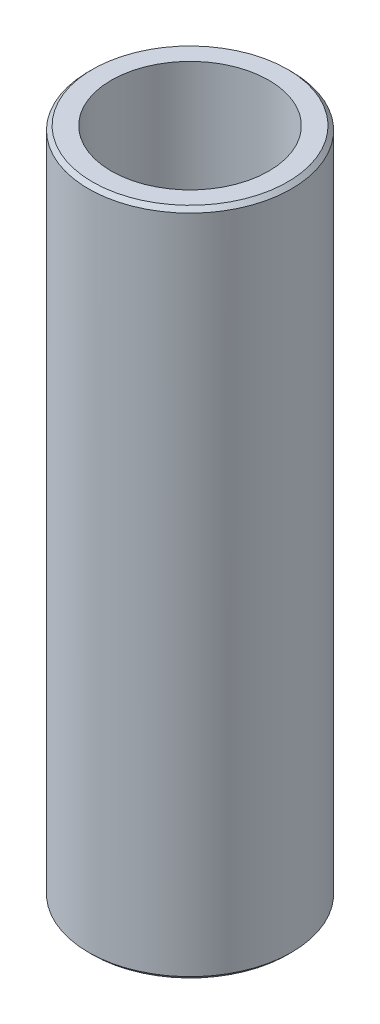
ISO-10303-21;
HEADER;
FILE_DESCRIPTION(('STEP AP214'),'2;1');
FILE_NAME('part.step','',(''),(''),'','','');
FILE_SCHEMA(('AUTOMOTIVE_DESIGN { 1 0 10303 214 1 1 1 1 }'));
ENDSEC;
DATA;
#1=APPLICATION_CONTEXT('core data for automotive mechanical design processes');
#2=APPLICATION_PROTOCOL_DEFINITION('international standard','automotive_design',2000,#1);
#3=PRODUCT_CONTEXT('',#1,'mechanical');
#4=PRODUCT('Part','Part','',(#3));
#5=PRODUCT_RELATED_PRODUCT_CATEGORY('part','',(#4));
#6=PRODUCT_DEFINITION_FORMATION('','',#4);
#7=PRODUCT_DEFINITION_CONTEXT('part definition',#1,'design');
#8=PRODUCT_DEFINITION('design','',#6,#7);
#9=PRODUCT_DEFINITION_SHAPE('','',#8);
#10=(LENGTH_UNIT() NAMED_UNIT(*) SI_UNIT(.MILLI.,.METRE.));
#11=(NAMED_UNIT(*) PLANE_ANGLE_UNIT() SI_UNIT($,.RADIAN.));
#12=(NAMED_UNIT(*) SI_UNIT($,.STERADIAN.) SOLID_ANGLE_UNIT());
#13=UNCERTAINTY_MEASURE_WITH_UNIT(LENGTH_MEASURE(1.E-05),#10,'distance_accuracy_value','');
#14=(GEOMETRIC_REPRESENTATION_CONTEXT(3) GLOBAL_UNCERTAINTY_ASSIGNED_CONTEXT((#13)) GLOBAL_UNIT_ASSIGNED_CONTEXT((#10,
#11,#12)) REPRESENTATION_CONTEXT('',''));
#15=CARTESIAN_POINT('',(0.,0.,0.));
#16=DIRECTION('',(0.,0.,1.));
#17=DIRECTION('',(1.,0.,0.));
#18=AXIS2_PLACEMENT_3D('',#15,#16,#17);
#19=CARTESIAN_POINT('',(0.,378.887556557986,0.));
#20=DIRECTION('',(0.,-1.,0.));
#21=DIRECTION('',(0.,0.,-1.));
#22=AXIS2_PLACEMENT_3D('',#19,#20,#21);
#23=CYLINDRICAL_SURFACE('',#22,57.5);
#24=CARTESIAN_POINT('',(0.,376.635877450938,0.));
#25=DIRECTION('',(0.,1.,0.));
#26=DIRECTION('',(0.,0.,1.));
#27=AXIS2_PLACEMENT_3D('',#24,#25,#26);
#28=CIRCLE('',#27,57.5);
#29=CARTESIAN_POINT('',(0.,376.635877450938,-57.5));
#30=VERTEX_POINT('',#29);
#31=EDGE_CURVE('E50',#30,#30,#28,.F.);
#32=CARTESIAN_POINT('',(0.,2.25167910704882,0.));
#33=DIRECTION('',(0.,1.,0.));
#34=DIRECTION('',(0.,0.,1.));
#35=AXIS2_PLACEMENT_3D('',#32,#33,#34);
#36=CIRCLE('',#35,57.5);
#37=CARTESIAN_POINT('',(0.,2.25167910704882,-57.5));
#38=VERTEX_POINT('',#37);
#39=EDGE_CURVE('E51',#38,#38,#36,.T.);
#40=CARTESIAN_POINT('',(0.,376.635877450938,-57.5));
#41=CARTESIAN_POINT('',(0.,372.736042051522,-57.5));
#42=CARTESIAN_POINT('',(0.,368.836206652107,-57.5));
#43=CARTESIAN_POINT('',(0.,361.036535853276,-57.5));
#44=CARTESIAN_POINT('',(0.,357.13670045386,-57.5));
#45=CARTESIAN_POINT('',(0.,349.337029655029,-57.5));
#46=CARTESIAN_POINT('',(0.,345.437194255614,-57.5));
#47=CARTESIAN_POINT('',(0.,337.637523456783,-57.5));
#48=CARTESIAN_POINT('',(0.,333.737688057367,-57.5));
#49=CARTESIAN_POINT('',(0.,325.938017258536,-57.5));
#50=CARTESIAN_POINT('',(0.,322.038181859121,-57.5));
#51=CARTESIAN_POINT('',(0.,314.23851106029,-57.5));
#52=CARTESIAN_POINT('',(0.,310.338675660874,-57.5));
#53=CARTESIAN_POINT('',(0.,302.539004862043,-57.5));
#54=CARTESIAN_POINT('',(0.,298.639169462628,-57.5));
#55=CARTESIAN_POINT('',(0.,290.839498663797,-57.5));
#56=CARTESIAN_POINT('',(0.,286.939663264381,-57.5));
#57=CARTESIAN_POINT('',(0.,279.13999246555,-57.5));
#58=CARTESIAN_POINT('',(0.,275.240157066135,-57.5));
#59=CARTESIAN_POINT('',(0.,267.440486267304,-57.5));
#60=CARTESIAN_POINT('',(0.,263.540650867888,-57.5));
#61=CARTESIAN_POINT('',(0.,255.740980069057,-57.5));
#62=CARTESIAN_POINT('',(0.,251.841144669642,-57.5));
#63=CARTESIAN_POINT('',(0.,244.041473870811,-57.5));
#64=CARTESIAN_POINT('',(0.,240.141638471395,-57.5));
#65=CARTESIAN_POINT('',(0.,232.341967672564,-57.5));
#66=CARTESIAN_POINT('',(0.,228.442132273149,-57.5));
#67=CARTESIAN_POINT('',(0.,220.642461474317,-57.5));
#68=CARTESIAN_POINT('',(0.,216.742626074902,-57.5));
#69=CARTESIAN_POINT('',(0.,208.942955276071,-57.5));
#70=CARTESIAN_POINT('',(0.,205.043119876655,-57.5));
#71=CARTESIAN_POINT('',(0.,197.243449077824,-57.5));
#72=CARTESIAN_POINT('',(0.,193.343613678409,-57.5));
#73=CARTESIAN_POINT('',(0.,185.543942879578,-57.5));
#74=CARTESIAN_POINT('',(0.,181.644107480162,-57.5));
#75=CARTESIAN_POINT('',(0.,173.844436681331,-57.5));
#76=CARTESIAN_POINT('',(0.,169.944601281916,-57.5));
#77=CARTESIAN_POINT('',(0.,162.144930483085,-57.5));
#78=CARTESIAN_POINT('',(0.,158.245095083669,-57.5));
#79=CARTESIAN_POINT('',(0.,150.445424284838,-57.5));
#80=CARTESIAN_POINT('',(0.,146.545588885423,-57.5));
#81=CARTESIAN_POINT('',(0.,138.745918086592,-57.5));
#82=CARTESIAN_POINT('',(0.,134.846082687176,-57.5));
#83=CARTESIAN_POINT('',(0.,127.046411888345,-57.5));
#84=CARTESIAN_POINT('',(0.,123.14657648893,-57.5));
#85=CARTESIAN_POINT('',(0.,115.346905690099,-57.5));
#86=CARTESIAN_POINT('',(0.,111.447070290683,-57.5));
#87=CARTESIAN_POINT('',(0.,103.647399491852,-57.5));
#88=CARTESIAN_POINT('',(0.,99.7475640924366,-57.5));
#89=CARTESIAN_POINT('',(0.,91.9478932936056,-57.5));
#90=CARTESIAN_POINT('',(0.,88.0480578941901,-57.5));
#91=CARTESIAN_POINT('',(0.,80.2483870953591,-57.5));
#92=CARTESIAN_POINT('',(0.,76.3485516959436,-57.5));
#93=CARTESIAN_POINT('',(0.,68.5488808971125,-57.5));
#94=CARTESIAN_POINT('',(0.,64.649045497697,-57.5));
#95=CARTESIAN_POINT('',(0.,56.849374698866,-57.5));
#96=CARTESIAN_POINT('',(0.,52.9495392994505,-57.5));
#97=CARTESIAN_POINT('',(0.,45.1498685006194,-57.5));
#98=CARTESIAN_POINT('',(0.,41.2500331012039,-57.5));
#99=CARTESIAN_POINT('',(0.,33.4503623023729,-57.5));
#100=CARTESIAN_POINT('',(0.,29.5505269029573,-57.5));
#101=CARTESIAN_POINT('',(0.,21.7508561041263,-57.5));
#102=CARTESIAN_POINT('',(0.,17.8510207047109,-57.5));
#103=CARTESIAN_POINT('',(0.,10.0513499058799,-57.5));
#104=CARTESIAN_POINT('',(0.,6.15151450646434,-57.5));
#105=CARTESIAN_POINT('',(0.,2.25167910704882,-57.5));
#106=B_SPLINE_CURVE_WITH_KNOTS('',3,(#40,#41,#42,#43,#44,#45,#46,#47,#48,#49,#50,#51,#52,#53,
#54,#55,#56,#57,#58,#59,#60,#61,#62,#63,#64,#65,#66,#67,#68,#69,#70,#71,#72,#73,#74,#75,#76,#77,
#78,#79,#80,#81,#82,#83,#84,#85,#86,#87,#88,#89,#90,#91,#92,#93,#94,#95,#96,#97,#98,#99,#100,
#101,#102,#103,#104,#105),.UNSPECIFIED.,.F.,.F.,(4,2,2,2,2,2,2,2,2,2,2,2,2,2,2,2,2,2,2,2,2,2,2,
2,2,2,2,2,2,2,2,2,4),(0.,11.6995061982466,23.3990123964931,35.0985185947396,46.7980247929862,
58.4975309912327,70.1970371894792,81.8965433877258,93.5960495859723,105.295555784219,
116.995061982465,128.694568180712,140.394074378958,152.093580577205,163.793086775452,
175.492592973698,187.192099171945,198.891605370191,210.591111568438,222.290617766684,
233.990123964931,245.689630163177,257.389136361424,269.08864255967,280.788148757917,
292.487654956163,304.18716115441,315.886667352657,327.586173550903,339.28567974915,
350.985185947396,362.684692145643,374.384198343889),.UNSPECIFIED.);
#107=EDGE_CURVE('BSEAM39',#30,#38,#106,.T.);
#108=ORIENTED_EDGE('',*,*,#31,.T.);
#109=ORIENTED_EDGE('',*,*,#39,.T.);
#110=ORIENTED_EDGE('',*,*,#107,.T.);
#111=ORIENTED_EDGE('',*,*,#107,.F.);
#112=EDGE_LOOP('',(#108,#110,#109,#111));
#113=FACE_BOUND('',#112,.T.);
#114=ADVANCED_FACE('F39',(#113),#23,.T.);
#115=CARTESIAN_POINT('',(0.,378.887556557986,0.));
#116=DIRECTION('',(0.,1.,0.));
#117=DIRECTION('',(0.,0.,1.));
#118=AXIS2_PLACEMENT_3D('',#115,#116,#117);
#119=PLANE('',#118);
#120=CARTESIAN_POINT('',(0.,378.887556557986,0.));
#121=DIRECTION('',(0.,1.,0.));
#122=DIRECTION('',(0.,0.,1.));
#123=AXIS2_PLACEMENT_3D('',#120,#121,#122);
#124=CIRCLE('',#123,55.2483208929515);
#125=CARTESIAN_POINT('',(0.,378.887556557986,55.2483208929515));
#126=VERTEX_POINT('',#125);
#127=EDGE_CURVE('E54',#126,#126,#124,.T.);
#128=ORIENTED_EDGE('',*,*,#127,.T.);
#129=EDGE_LOOP('',(#128));
#130=FACE_BOUND('',#129,.T.);
#131=CARTESIAN_POINT('',(0.,378.887556557986,0.));
#132=DIRECTION('',(0.,1.,0.));
#133=DIRECTION('',(0.,0.,1.));
#134=AXIS2_PLACEMENT_3D('',#131,#132,#133);
#135=CIRCLE('',#134,44.6006034622384);
#136=CARTESIAN_POINT('',(0.,378.887556557986,-44.6006034622384));
#137=VERTEX_POINT('',#136);
#138=EDGE_CURVE('E58',#137,#137,#135,.T.);
#139=ORIENTED_EDGE('',*,*,#138,.F.);
#140=EDGE_LOOP('',(#139));
#141=FACE_BOUND('',#140,.T.);
#142=ADVANCED_FACE('F69',(#130,#141),#119,.T.);
#143=CARTESIAN_POINT('',(0.,0.,0.));
#144=DIRECTION('',(0.,1.,0.));
#145=DIRECTION('',(0.,0.,1.));
#146=AXIS2_PLACEMENT_3D('',#143,#144,#145);
#147=PLANE('',#146);
#148=CARTESIAN_POINT('',(0.,0.,0.));
#149=DIRECTION('',(0.,1.,0.));
#150=DIRECTION('',(0.,0.,1.));
#151=AXIS2_PLACEMENT_3D('',#148,#149,#150);
#152=CIRCLE('',#151,55.2483208929512);
#153=CARTESIAN_POINT('',(0.,0.,55.2483208929512));
#154=VERTEX_POINT('',#153);
#155=EDGE_CURVE('E10',#154,#154,#152,.F.);
#156=ORIENTED_EDGE('',*,*,#155,.T.);
#157=EDGE_LOOP('',(#156));
#158=FACE_BOUND('',#157,.T.);
#159=CARTESIAN_POINT('',(0.,0.,0.));
#160=DIRECTION('',(0.,1.,0.));
#161=DIRECTION('',(0.,0.,1.));
#162=AXIS2_PLACEMENT_3D('',#159,#160,#161);
#163=CIRCLE('',#162,44.6006034622384);
#164=CARTESIAN_POINT('',(0.,0.,-44.6006034622384));
#165=VERTEX_POINT('',#164);
#166=EDGE_CURVE('E63',#165,#165,#163,.T.);
#167=ORIENTED_EDGE('',*,*,#166,.T.);
#168=EDGE_LOOP('',(#167));
#169=FACE_BOUND('',#168,.T.);
#170=ADVANCED_FACE('F75',(#158,#169),#147,.F.);
#171=CARTESIAN_POINT('',(0.,378.887556557986,0.));
#172=DIRECTION('',(0.,-1.,0.));
#173=DIRECTION('',(0.,0.,-1.));
#174=AXIS2_PLACEMENT_3D('',#171,#172,#173);
#175=CYLINDRICAL_SURFACE('',#174,44.6006034622384);
#176=CARTESIAN_POINT('',(0.,378.887556557986,-44.6006034622384));
#177=CARTESIAN_POINT('',(0.,374.940811177174,-44.6006034622384));
#178=CARTESIAN_POINT('',(0.,370.994065796362,-44.6006034622384));
#179=CARTESIAN_POINT('',(0.,363.100575034737,-44.6006034622384));
#180=CARTESIAN_POINT('',(0.,359.153829653925,-44.6006034622384));
#181=CARTESIAN_POINT('',(0.,351.2603388923,-44.6006034622384));
#182=CARTESIAN_POINT('',(0.,347.313593511488,-44.6006034622384));
#183=CARTESIAN_POINT('',(0.,339.420102749863,-44.6006034622384));
#184=CARTESIAN_POINT('',(0.,335.473357369051,-44.6006034622384));
#185=CARTESIAN_POINT('',(0.,327.579866607426,-44.6006034622384));
#186=CARTESIAN_POINT('',(0.,323.633121226613,-44.6006034622384));
#187=CARTESIAN_POINT('',(0.,315.739630464989,-44.6006034622384));
#188=CARTESIAN_POINT('',(0.,311.792885084176,-44.6006034622384));
#189=CARTESIAN_POINT('',(0.,303.899394322552,-44.6006034622384));
#190=CARTESIAN_POINT('',(0.,299.952648941739,-44.6006034622384));
#191=CARTESIAN_POINT('',(0.,292.059158180115,-44.6006034622384));
#192=CARTESIAN_POINT('',(0.,288.112412799302,-44.6006034622384));
#193=CARTESIAN_POINT('',(0.,280.218922037677,-44.6006034622384));
#194=CARTESIAN_POINT('',(0.,276.272176656865,-44.6006034622384));
#195=CARTESIAN_POINT('',(0.,268.37868589524,-44.6006034622384));
#196=CARTESIAN_POINT('',(0.,264.431940514428,-44.6006034622384));
#197=CARTESIAN_POINT('',(0.,256.538449752803,-44.6006034622384));
#198=CARTESIAN_POINT('',(0.,252.591704371991,-44.6006034622384));
#199=CARTESIAN_POINT('',(0.,244.698213610366,-44.6006034622384));
#200=CARTESIAN_POINT('',(0.,240.751468229554,-44.6006034622384));
#201=CARTESIAN_POINT('',(0.,232.857977467929,-44.6006034622384));
#202=CARTESIAN_POINT('',(0.,228.911232087117,-44.6006034622384));
#203=CARTESIAN_POINT('',(0.,221.017741325492,-44.6006034622384));
#204=CARTESIAN_POINT('',(0.,217.07099594468,-44.6006034622384));
#205=CARTESIAN_POINT('',(0.,209.177505183055,-44.6006034622384));
#206=CARTESIAN_POINT('',(0.,205.230759802243,-44.6006034622384));
#207=CARTESIAN_POINT('',(0.,197.337269040618,-44.6006034622384));
#208=CARTESIAN_POINT('',(0.,193.390523659806,-44.6006034622384));
#209=CARTESIAN_POINT('',(0.,185.497032898181,-44.6006034622384));
#210=CARTESIAN_POINT('',(0.,181.550287517369,-44.6006034622384));
#211=CARTESIAN_POINT('',(0.,173.656796755744,-44.6006034622384));
#212=CARTESIAN_POINT('',(0.,169.710051374931,-44.6006034622384));
#213=CARTESIAN_POINT('',(0.,161.816560613307,-44.6006034622384));
#214=CARTESIAN_POINT('',(0.,157.869815232494,-44.6006034622384));
#215=CARTESIAN_POINT('',(0.,149.97632447087,-44.6006034622384));
#216=CARTESIAN_POINT('',(0.,146.029579090057,-44.6006034622384));
#217=CARTESIAN_POINT('',(0.,138.136088328433,-44.6006034622384));
#218=CARTESIAN_POINT('',(0.,134.18934294762,-44.6006034622384));
#219=CARTESIAN_POINT('',(0.,126.295852185996,-44.6006034622384));
#220=CARTESIAN_POINT('',(0.,122.349106805183,-44.6006034622384));
#221=CARTESIAN_POINT('',(0.,114.455616043558,-44.6006034622384));
#222=CARTESIAN_POINT('',(0.,110.508870662746,-44.6006034622384));
#223=CARTESIAN_POINT('',(0.,102.615379901121,-44.6006034622384));
#224=CARTESIAN_POINT('',(0.,98.668634520309,-44.6006034622384));
#225=CARTESIAN_POINT('',(0.,90.7751437586843,-44.6006034622384));
#226=CARTESIAN_POINT('',(0.,86.8283983778719,-44.6006034622384));
#227=CARTESIAN_POINT('',(0.,78.9349076162472,-44.6006034622384));
#228=CARTESIAN_POINT('',(0.,74.9881622354348,-44.6006034622384));
#229=CARTESIAN_POINT('',(0.,67.0946714738101,-44.6006034622384));
#230=CARTESIAN_POINT('',(0.,63.1479260929977,-44.6006034622384));
#231=CARTESIAN_POINT('',(0.,55.254435331373,-44.6006034622384));
#232=CARTESIAN_POINT('',(0.,51.3076899505607,-44.6006034622384));
#233=CARTESIAN_POINT('',(0.,43.414199188936,-44.6006034622384));
#234=CARTESIAN_POINT('',(0.,39.4674538081236,-44.6006034622384));
#235=CARTESIAN_POINT('',(0.,31.5739630464989,-44.6006034622384));
#236=CARTESIAN_POINT('',(0.,27.6272176656865,-44.6006034622384));
#237=CARTESIAN_POINT('',(0.,19.7337269040618,-44.6006034622384));
#238=CARTESIAN_POINT('',(0.,15.7869815232494,-44.6006034622384));
#239=CARTESIAN_POINT('',(0.,7.89349076162471,-44.6006034622384));
#240=CARTESIAN_POINT('',(0.,3.94674538081236,-44.6006034622384));
#241=CARTESIAN_POINT('',(0.,0.,-44.6006034622384));
#242=B_SPLINE_CURVE_WITH_KNOTS('',3,(#176,#177,#178,#179,#180,#181,#182,#183,#184,#185,#186,
#187,#188,#189,#190,#191,#192,#193,#194,#195,#196,#197,#198,#199,#200,#201,#202,#203,#204,#205,
#206,#207,#208,#209,#210,#211,#212,#213,#214,#215,#216,#217,#218,#219,#220,#221,#222,#223,#224,
#225,#226,#227,#228,#229,#230,#231,#232,#233,#234,#235,#236,#237,#238,#239,#240,#241),
.UNSPECIFIED.,.F.,.F.,(4,2,2,2,2,2,2,2,2,2,2,2,2,2,2,2,2,2,2,2,2,2,2,2,2,2,2,2,2,2,2,2,4),(0.,
11.8402361424371,23.6804722848741,35.5207084273112,47.3609445697483,59.2011807121854,
71.0414168546224,82.8816529970595,94.7218891394966,106.562125281934,118.402361424371,
130.242597566808,142.082833709245,153.923069851682,165.763305994119,177.603542136556,
189.443778278993,201.28401442143,213.124250563867,224.964486706304,236.804722848742,
248.644958991179,260.485195133616,272.325431276053,284.16566741849,296.005903560927,
307.846139703364,319.686375845801,331.526611988238,343.366848130675,355.207084273112,
367.047320415549,378.887556557986),.UNSPECIFIED.);
#243=EDGE_CURVE('BSEAM70',#137,#165,#242,.T.);
#244=ORIENTED_EDGE('',*,*,#138,.T.);
#245=ORIENTED_EDGE('',*,*,#166,.F.);
#246=ORIENTED_EDGE('',*,*,#243,.T.);
#247=ORIENTED_EDGE('',*,*,#243,.F.);
#248=EDGE_LOOP('',(#244,#246,#245,#247));
#249=FACE_BOUND('',#248,.T.);
#250=ADVANCED_FACE('F70',(#249),#175,.F.);
#251=CARTESIAN_POINT('',(0.,378.887556557986,0.));
#252=DIRECTION('',(0.,-1.,0.));
#253=DIRECTION('',(0.,0.,-1.));
#254=AXIS2_PLACEMENT_3D('',#251,#252,#253);
#255=CONICAL_SURFACE('',#254,55.2483208929515,0.785398163397451);
#256=ORIENTED_EDGE('',*,*,#31,.F.);
#257=EDGE_LOOP('',(#256));
#258=FACE_BOUND('',#257,.T.);
#259=ORIENTED_EDGE('',*,*,#127,.F.);
#260=EDGE_LOOP('',(#259));
#261=FACE_BOUND('',#260,.T.);
#262=ADVANCED_FACE('F81',(#258,#261),#255,.T.);
#263=CARTESIAN_POINT('',(0.,2.25167910704882,0.));
#264=DIRECTION('',(0.,1.,0.));
#265=DIRECTION('',(0.,0.,1.));
#266=AXIS2_PLACEMENT_3D('',#263,#264,#265);
#267=CONICAL_SURFACE('',#266,57.5,0.785398163397451);
#268=ORIENTED_EDGE('',*,*,#155,.F.);
#269=EDGE_LOOP('',(#268));
#270=FACE_BOUND('',#269,.T.);
#271=ORIENTED_EDGE('',*,*,#39,.F.);
#272=EDGE_LOOP('',(#271));
#273=FACE_BOUND('',#272,.T.);
#274=ADVANCED_FACE('F45',(#270,#273),#267,.T.);
#275=CLOSED_SHELL('',(#114,#142,#170,#250,#262,#274));
#276=MANIFOLD_SOLID_BREP('B2',#275);
#277=ADVANCED_BREP_SHAPE_REPRESENTATION('',(#18,#276),#14);
#278=SHAPE_DEFINITION_REPRESENTATION(#9,#277);
ENDSEC;
END-ISO-10303-21;
